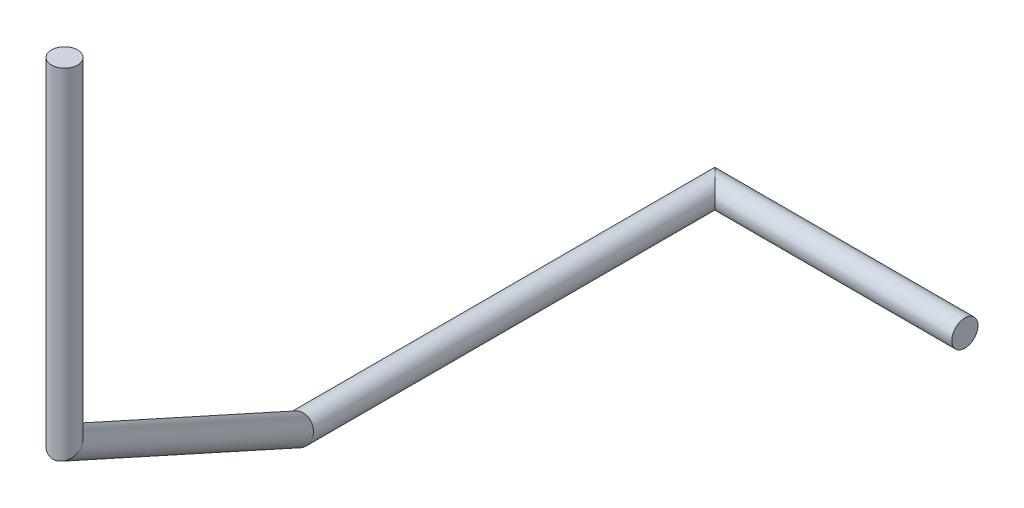
ISO-10303-21;
HEADER;
FILE_DESCRIPTION(('STEP AP214'),'2;1');
FILE_NAME('part.step','',(''),(''),'','','');
FILE_SCHEMA(('AUTOMOTIVE_DESIGN { 1 0 10303 214 1 1 1 1 }'));
ENDSEC;
DATA;
#1=APPLICATION_CONTEXT('core data for automotive mechanical design processes');
#2=APPLICATION_PROTOCOL_DEFINITION('international standard','automotive_design',2000,#1);
#3=PRODUCT_CONTEXT('',#1,'mechanical');
#4=PRODUCT('Part','Part','',(#3));
#5=PRODUCT_RELATED_PRODUCT_CATEGORY('part','',(#4));
#6=PRODUCT_DEFINITION_FORMATION('','',#4);
#7=PRODUCT_DEFINITION_CONTEXT('part definition',#1,'design');
#8=PRODUCT_DEFINITION('design','',#6,#7);
#9=PRODUCT_DEFINITION_SHAPE('','',#8);
#10=(LENGTH_UNIT() NAMED_UNIT(*) SI_UNIT(.MILLI.,.METRE.));
#11=(NAMED_UNIT(*) PLANE_ANGLE_UNIT() SI_UNIT($,.RADIAN.));
#12=(NAMED_UNIT(*) SI_UNIT($,.STERADIAN.) SOLID_ANGLE_UNIT());
#13=UNCERTAINTY_MEASURE_WITH_UNIT(LENGTH_MEASURE(1.E-05),#10,'distance_accuracy_value','');
#14=(GEOMETRIC_REPRESENTATION_CONTEXT(3) GLOBAL_UNCERTAINTY_ASSIGNED_CONTEXT((#13)) GLOBAL_UNIT_ASSIGNED_CONTEXT((#10,
#11,#12)) REPRESENTATION_CONTEXT('',''));
#15=CARTESIAN_POINT('',(0.,0.,0.));
#16=DIRECTION('',(0.,0.,1.));
#17=DIRECTION('',(1.,0.,0.));
#18=AXIS2_PLACEMENT_3D('',#15,#16,#17);
#19=CARTESIAN_POINT('',(-10.8254671167749,41.6480604530859,57.7580774061755));
#20=DIRECTION('',(0.,-1.,0.));
#21=DIRECTION('',(-0.975600211275179,0.,0.219554612249041));
#22=AXIS2_PLACEMENT_3D('',#19,#20,#21);
#23=PLANE('',#22);
#24=CARTESIAN_POINT('',(-10.8254671167749,41.6480604530859,57.7580774061755));
#25=DIRECTION('',(0.,-1.,0.));
#26=DIRECTION('',(-0.975600211275179,0.,0.219554612249041));
#27=AXIS2_PLACEMENT_3D('',#24,#25,#26);
#28=CIRCLE('',#27,1.);
#29=CARTESIAN_POINT('',(-11.80106732805,41.6480604530859,57.9776320184245));
#30=VERTEX_POINT('',#29);
#31=EDGE_CURVE('E44',#30,#30,#28,.T.);
#32=ORIENTED_EDGE('',*,*,#31,.F.);
#33=EDGE_LOOP('',(#32));
#34=FACE_BOUND('',#33,.T.);
#35=ADVANCED_FACE('F41',(#34),#23,.F.);
#36=CARTESIAN_POINT('',(0.,0.,0.));
#37=DIRECTION('',(1.,0.,0.));
#38=DIRECTION('',(0.,0.,-1.));
#39=AXIS2_PLACEMENT_3D('',#36,#37,#38);
#40=PLANE('',#39);
#41=CARTESIAN_POINT('',(0.,0.,0.));
#42=DIRECTION('',(1.,0.,0.));
#43=DIRECTION('',(0.,0.,-1.));
#44=AXIS2_PLACEMENT_3D('',#41,#42,#43);
#45=CIRCLE('',#44,1.);
#46=CARTESIAN_POINT('',(0.,0.,-1.));
#47=VERTEX_POINT('',#46);
#48=EDGE_CURVE('E49',#47,#47,#45,.T.);
#49=ORIENTED_EDGE('',*,*,#48,.T.);
#50=EDGE_LOOP('',(#49));
#51=FACE_BOUND('',#50,.T.);
#52=ADVANCED_FACE('F72',(#51),#40,.T.);
#53=CARTESIAN_POINT('',(-10.8254671167749,14.8492722892399,57.7580774061755));
#54=DIRECTION('',(0.,1.,0.));
#55=DIRECTION('',(0.,0.,1.));
#56=AXIS2_PLACEMENT_3D('',#53,#54,#55);
#57=CYLINDRICAL_SURFACE('',#56,1.);
#58=CARTESIAN_POINT('',(-10.8254671167749,16.2480604530859,57.7580774061755));
#59=DIRECTION('',(0.148974705133083,0.869410701432374,0.471096136118074));
#60=DIRECTION('',(0.262138831510709,-0.494090105380454,0.828950059279407));
#61=AXIS2_PLACEMENT_3D('',#58,#59,#60);
#62=ELLIPSE('',#61,1.15020438367331,1.);
#63=CARTESIAN_POINT('',(-10.5239538836402,15.6797558479477,58.7115393982049));
#64=VERTEX_POINT('',#63);
#65=EDGE_CURVE('E60',#64,#64,#62,.T.);
#66=ORIENTED_EDGE('',*,*,#65,.T.);
#67=EDGE_LOOP('',(#66));
#68=FACE_BOUND('',#67,.T.);
#69=ORIENTED_EDGE('',*,*,#31,.T.);
#70=EDGE_LOOP('',(#69));
#71=FACE_BOUND('',#70,.T.);
#72=ADVANCED_FACE('F69',(#68,#71),#57,.T.);
#73=CARTESIAN_POINT('',(-19.2767958408243,-0.448048853903694,31.0328135205601));
#74=DIRECTION('',(0.25904040577087,0.511749935530265,0.819152044288991));
#75=DIRECTION('',(0.,-0.84810070172823,0.529835068420432));
#76=AXIS2_PLACEMENT_3D('',#73,#74,#75);
#77=CYLINDRICAL_SURFACE('',#76,1.);
#78=CARTESIAN_POINT('',(-19.05,0.,31.75));
#79=DIRECTION('',(0.135805705019526,0.268292356096207,0.953716950748227));
#80=DIRECTION('',(-0.430720668171198,-0.850914642108509,0.300705799504274));
#81=AXIS2_PLACEMENT_3D('',#78,#79,#80);
#82=ELLIPSE('',#81,1.04852912514081,1.);
#83=CARTESIAN_POINT('',(-19.5016231653776,-0.892208785259541,32.065298788879));
#84=VERTEX_POINT('',#83);
#85=EDGE_CURVE('E55',#84,#84,#82,.T.);
#86=ORIENTED_EDGE('',*,*,#85,.T.);
#87=EDGE_LOOP('',(#86));
#88=FACE_BOUND('',#87,.T.);
#89=ORIENTED_EDGE('',*,*,#65,.F.);
#90=EDGE_LOOP('',(#89));
#91=FACE_BOUND('',#90,.T.);
#92=ADVANCED_FACE('F85',(#88,#91),#77,.T.);
#93=CARTESIAN_POINT('',(-19.05,0.,-1.2));
#94=DIRECTION('',(0.,0.,1.));
#95=DIRECTION('',(1.,0.,0.));
#96=AXIS2_PLACEMENT_3D('',#93,#94,#95);
#97=CYLINDRICAL_SURFACE('',#96,1.);
#98=CARTESIAN_POINT('',(-19.05,0.,0.));
#99=DIRECTION('',(-0.707106781186548,0.,0.707106781186548));
#100=DIRECTION('',(-0.707106781186548,0.,-0.707106781186548));
#101=AXIS2_PLACEMENT_3D('',#98,#99,#100);
#102=ELLIPSE('',#101,1.41421356237309,1.);
#103=CARTESIAN_POINT('',(-20.05,0.,-1.));
#104=VERTEX_POINT('',#103);
#105=EDGE_CURVE('E10',#104,#104,#102,.T.);
#106=ORIENTED_EDGE('',*,*,#105,.T.);
#107=EDGE_LOOP('',(#106));
#108=FACE_BOUND('',#107,.T.);
#109=ORIENTED_EDGE('',*,*,#85,.F.);
#110=EDGE_LOOP('',(#109));
#111=FACE_BOUND('',#110,.T.);
#112=ADVANCED_FACE('F79',(#108,#111),#97,.T.);
#113=CARTESIAN_POINT('',(0.,0.,0.));
#114=DIRECTION('',(-1.,0.,0.));
#115=DIRECTION('',(0.,0.,1.));
#116=AXIS2_PLACEMENT_3D('',#113,#114,#115);
#117=CYLINDRICAL_SURFACE('',#116,1.);
#118=ORIENTED_EDGE('',*,*,#48,.F.);
#119=EDGE_LOOP('',(#118));
#120=FACE_BOUND('',#119,.T.);
#121=ORIENTED_EDGE('',*,*,#105,.F.);
#122=EDGE_LOOP('',(#121));
#123=FACE_BOUND('',#122,.T.);
#124=ADVANCED_FACE('F77',(#120,#123),#117,.T.);
#125=CLOSED_SHELL('',(#35,#52,#72,#92,#112,#124));
#126=MANIFOLD_SOLID_BREP('B2',#125);
#127=ADVANCED_BREP_SHAPE_REPRESENTATION('',(#18,#126),#14);
#128=SHAPE_DEFINITION_REPRESENTATION(#9,#127);
ENDSEC;
END-ISO-10303-21;
